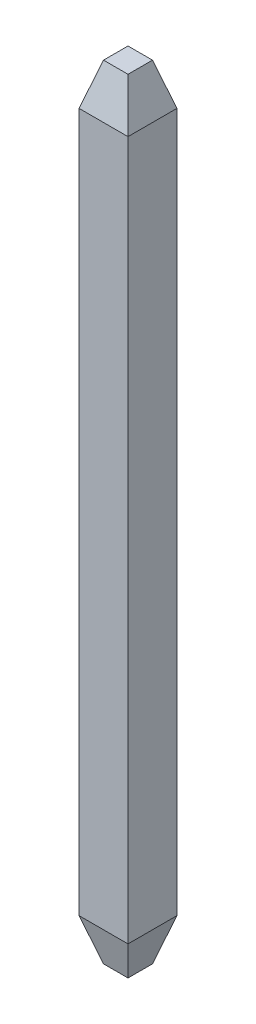
ISO-10303-21;
HEADER;
FILE_DESCRIPTION(('STEP AP214'),'2;1');
FILE_NAME('part.step','',(''),(''),'','','');
FILE_SCHEMA(('AUTOMOTIVE_DESIGN { 1 0 10303 214 1 1 1 1 }'));
ENDSEC;
DATA;
#1=APPLICATION_CONTEXT('core data for automotive mechanical design processes');
#2=APPLICATION_PROTOCOL_DEFINITION('international standard','automotive_design',2000,#1);
#3=PRODUCT_CONTEXT('',#1,'mechanical');
#4=PRODUCT('Part','Part','',(#3));
#5=PRODUCT_RELATED_PRODUCT_CATEGORY('part','',(#4));
#6=PRODUCT_DEFINITION_FORMATION('','',#4);
#7=PRODUCT_DEFINITION_CONTEXT('part definition',#1,'design');
#8=PRODUCT_DEFINITION('design','',#6,#7);
#9=PRODUCT_DEFINITION_SHAPE('','',#8);
#10=(LENGTH_UNIT() NAMED_UNIT(*) SI_UNIT(.MILLI.,.METRE.));
#11=(NAMED_UNIT(*) PLANE_ANGLE_UNIT() SI_UNIT($,.RADIAN.));
#12=(NAMED_UNIT(*) SI_UNIT($,.STERADIAN.) SOLID_ANGLE_UNIT());
#13=UNCERTAINTY_MEASURE_WITH_UNIT(LENGTH_MEASURE(1.E-05),#10,'distance_accuracy_value','');
#14=(GEOMETRIC_REPRESENTATION_CONTEXT(3) GLOBAL_UNCERTAINTY_ASSIGNED_CONTEXT((#13)) GLOBAL_UNIT_ASSIGNED_CONTEXT((#10,
#11,#12)) REPRESENTATION_CONTEXT('',''));
#15=CARTESIAN_POINT('',(0.,0.,0.));
#16=DIRECTION('',(0.,0.,1.));
#17=DIRECTION('',(1.,0.,0.));
#18=AXIS2_PLACEMENT_3D('',#15,#16,#17);
#19=CARTESIAN_POINT('',(6.19000000001294,-5.53543505344786,-19.1989999999763));
#20=DIRECTION('',(-1.,0.,0.));
#21=DIRECTION('',(0.,0.,1.));
#22=AXIS2_PLACEMENT_3D('',#19,#20,#21);
#23=PLANE('',#22);
#24=DIRECTION('',(0.,1.,0.));
#25=VECTOR('',#24,1.);
#26=CARTESIAN_POINT('',(6.19000000001294,-10.1039999999831,-19.8399999999763));
#27=LINE('',#26,#25);
#28=CARTESIAN_POINT('',(6.19000000001294,-10.1039999999831,-19.8399999999763));
#29=VERTEX_POINT('',#28);
#30=CARTESIAN_POINT('',(6.19000000001294,-0.965870106912631,-19.8399999999763));
#31=VERTEX_POINT('',#30);
#32=EDGE_CURVE('E158',#29,#31,#27,.T.);
#33=ORIENTED_EDGE('',*,*,#32,.F.);
#34=DIRECTION('',(0.,0.,-1.));
#35=VECTOR('',#34,1.);
#36=CARTESIAN_POINT('',(6.19000000001294,-10.1039999999831,-19.1999999999763));
#37=LINE('',#36,#35);
#38=CARTESIAN_POINT('',(6.19000000001294,-10.1039999999831,-19.1999999999763));
#39=VERTEX_POINT('',#38);
#40=EDGE_CURVE('E42',#39,#29,#37,.T.);
#41=ORIENTED_EDGE('',*,*,#40,.F.);
#42=DIRECTION('',(0.,1.,0.));
#43=VECTOR('',#42,1.);
#44=CARTESIAN_POINT('',(6.19000000001294,-10.1039999999831,-19.1999999999763));
#45=LINE('',#44,#43);
#46=CARTESIAN_POINT('',(6.19000000001294,-0.965870106912631,-19.1999999999763));
#47=VERTEX_POINT('',#46);
#48=EDGE_CURVE('E11',#39,#47,#45,.T.);
#49=ORIENTED_EDGE('',*,*,#48,.T.);
#50=DIRECTION('',(0.,0.,-1.));
#51=VECTOR('',#50,1.);
#52=CARTESIAN_POINT('',(6.19000000001294,-0.965870106912629,-19.1999999999763));
#53=LINE('',#52,#51);
#54=EDGE_CURVE('E28',#47,#31,#53,.T.);
#55=ORIENTED_EDGE('',*,*,#54,.T.);
#56=EDGE_LOOP('',(#33,#41,#49,#55));
#57=FACE_BOUND('',#56,.T.);
#58=ADVANCED_FACE('F17',(#57),#23,.T.);
#59=CARTESIAN_POINT('',(6.83100000001296,-5.53443505344787,-19.8399999999763));
#60=DIRECTION('',(0.,0.,-1.));
#61=DIRECTION('',(0.,-1.,0.));
#62=AXIS2_PLACEMENT_3D('',#59,#60,#61);
#63=PLANE('',#62);
#64=DIRECTION('',(0.,1.,0.));
#65=VECTOR('',#64,1.);
#66=CARTESIAN_POINT('',(6.83000000001296,-10.1039999999831,-19.8399999999763));
#67=LINE('',#66,#65);
#68=CARTESIAN_POINT('',(6.83000000001293,-10.1039999999831,-19.8399999999763));
#69=VERTEX_POINT('',#68);
#70=CARTESIAN_POINT('',(6.83000000001293,-0.965870106912631,-19.8399999999763));
#71=VERTEX_POINT('',#70);
#72=EDGE_CURVE('E151',#69,#71,#67,.T.);
#73=ORIENTED_EDGE('',*,*,#72,.F.);
#74=DIRECTION('',(1.,0.,0.));
#75=VECTOR('',#74,1.);
#76=CARTESIAN_POINT('',(6.19000000001294,-10.1039999999831,-19.8399999999763));
#77=LINE('',#76,#75);
#78=EDGE_CURVE('E205',#29,#69,#77,.T.);
#79=ORIENTED_EDGE('',*,*,#78,.F.);
#80=ORIENTED_EDGE('',*,*,#32,.T.);
#81=DIRECTION('',(1.,0.,0.));
#82=VECTOR('',#81,1.);
#83=CARTESIAN_POINT('',(6.19000000001294,-0.965870106912629,-19.8399999999763));
#84=LINE('',#83,#82);
#85=EDGE_CURVE('E155',#31,#71,#84,.T.);
#86=ORIENTED_EDGE('',*,*,#85,.T.);
#87=EDGE_LOOP('',(#73,#79,#80,#86));
#88=FACE_BOUND('',#87,.T.);
#89=ADVANCED_FACE('F304',(#88),#63,.T.);
#90=CARTESIAN_POINT('',(6.83000000001296,-11.0738701069126,-19.5199999999763));
#91=DIRECTION('',(1.,0.,0.));
#92=DIRECTION('',(0.,1.,0.));
#93=AXIS2_PLACEMENT_3D('',#90,#91,#92);
#94=PLANE('',#93);
#95=DIRECTION('',(0.,1.,0.));
#96=VECTOR('',#95,1.);
#97=CARTESIAN_POINT('',(6.83000000001296,-10.1039999999831,-19.1999999999763));
#98=LINE('',#97,#96);
#99=CARTESIAN_POINT('',(6.83000000001293,-10.1039999999831,-19.1999999999763));
#100=VERTEX_POINT('',#99);
#101=CARTESIAN_POINT('',(6.83000000001293,-0.965870106912631,-19.1999999999763));
#102=VERTEX_POINT('',#101);
#103=EDGE_CURVE('E160',#100,#102,#98,.T.);
#104=ORIENTED_EDGE('',*,*,#103,.F.);
#105=DIRECTION('',(0.,0.,1.));
#106=VECTOR('',#105,1.);
#107=CARTESIAN_POINT('',(6.83000000001296,-10.1039999999831,-19.8399999999763));
#108=LINE('',#107,#106);
#109=EDGE_CURVE('E266',#69,#100,#108,.T.);
#110=ORIENTED_EDGE('',*,*,#109,.F.);
#111=ORIENTED_EDGE('',*,*,#72,.T.);
#112=DIRECTION('',(0.,0.,1.));
#113=VECTOR('',#112,1.);
#114=CARTESIAN_POINT('',(6.83000000001296,-0.965870106912629,-19.8399999999763));
#115=LINE('',#114,#113);
#116=EDGE_CURVE('E131',#71,#102,#115,.T.);
#117=ORIENTED_EDGE('',*,*,#116,.T.);
#118=EDGE_LOOP('',(#104,#110,#111,#117));
#119=FACE_BOUND('',#118,.T.);
#120=ADVANCED_FACE('F307',(#119),#94,.T.);
#121=CARTESIAN_POINT('',(6.83000000001296,-0.965870106912629,-19.5199999999763));
#122=DIRECTION('',(0.959644900900968,0.281214622974643,0.));
#123=DIRECTION('',(0.,0.,-1.));
#124=AXIS2_PLACEMENT_3D('',#121,#122,#123);
#125=PLANE('',#124);
#126=DIRECTION('',(-0.270714017147727,0.923811583516618,0.270714017147727));
#127=VECTOR('',#126,1.);
#128=CARTESIAN_POINT('',(6.83000000001296,-0.965870106912629,-19.8399999999763));
#129=LINE('',#128,#127);
#130=CARTESIAN_POINT('',(6.67000000001293,-0.419870106912635,-19.6799999999763));
#131=VERTEX_POINT('',#130);
#132=EDGE_CURVE('E137',#71,#131,#129,.T.);
#133=ORIENTED_EDGE('',*,*,#132,.T.);
#134=DIRECTION('',(0.,0.,1.));
#135=VECTOR('',#134,1.);
#136=CARTESIAN_POINT('',(6.67000000001296,-0.419870106912629,-19.6799999999763));
#137=LINE('',#136,#135);
#138=CARTESIAN_POINT('',(6.67000000001293,-0.419870106912635,-19.3599999999763));
#139=VERTEX_POINT('',#138);
#140=EDGE_CURVE('E133',#131,#139,#137,.T.);
#141=ORIENTED_EDGE('',*,*,#140,.T.);
#142=DIRECTION('',(-0.270714017147727,0.923811583516618,-0.270714017147727));
#143=VECTOR('',#142,1.);
#144=CARTESIAN_POINT('',(6.83000000001296,-0.965870106912629,-19.1999999999763));
#145=LINE('',#144,#143);
#146=EDGE_CURVE('E138',#102,#139,#145,.T.);
#147=ORIENTED_EDGE('',*,*,#146,.F.);
#148=ORIENTED_EDGE('',*,*,#116,.F.);
#149=EDGE_LOOP('',(#133,#141,#147,#148));
#150=FACE_BOUND('',#149,.T.);
#151=ADVANCED_FACE('F19',(#150),#125,.T.);
#152=CARTESIAN_POINT('',(6.51000000001295,-0.965870106912629,-19.1999999999763));
#153=DIRECTION('',(0.,0.281214622974643,0.959644900900968));
#154=DIRECTION('',(1.,0.,0.));
#155=AXIS2_PLACEMENT_3D('',#152,#153,#154);
#156=PLANE('',#155);
#157=ORIENTED_EDGE('',*,*,#146,.T.);
#158=DIRECTION('',(-1.,0.,0.));
#159=VECTOR('',#158,1.);
#160=CARTESIAN_POINT('',(6.67000000001296,-0.419870106912629,-19.3599999999763));
#161=LINE('',#160,#159);
#162=CARTESIAN_POINT('',(6.35000000001294,-0.419870106912635,-19.3599999999763));
#163=VERTEX_POINT('',#162);
#164=EDGE_CURVE('E21',#139,#163,#161,.T.);
#165=ORIENTED_EDGE('',*,*,#164,.T.);
#166=DIRECTION('',(0.270714017147727,0.923811583516618,-0.270714017147727));
#167=VECTOR('',#166,1.);
#168=CARTESIAN_POINT('',(6.19000000001294,-0.965870106912629,-19.1999999999763));
#169=LINE('',#168,#167);
#170=EDGE_CURVE('E143',#47,#163,#169,.T.);
#171=ORIENTED_EDGE('',*,*,#170,.F.);
#172=DIRECTION('',(-1.,0.,0.));
#173=VECTOR('',#172,1.);
#174=CARTESIAN_POINT('',(6.83000000001296,-0.965870106912629,-19.1999999999763));
#175=LINE('',#174,#173);
#176=EDGE_CURVE('E127',#102,#47,#175,.T.);
#177=ORIENTED_EDGE('',*,*,#176,.F.);
#178=EDGE_LOOP('',(#157,#165,#171,#177));
#179=FACE_BOUND('',#178,.T.);
#180=ADVANCED_FACE('F351',(#179),#156,.T.);
#181=CARTESIAN_POINT('',(6.51000000001295,-0.419870106912629,-19.6809999999763));
#182=DIRECTION('',(0.,1.,0.));
#183=DIRECTION('',(1.,0.,0.));
#184=AXIS2_PLACEMENT_3D('',#181,#182,#183);
#185=PLANE('',#184);
#186=DIRECTION('',(1.,0.,0.));
#187=VECTOR('',#186,1.);
#188=CARTESIAN_POINT('',(6.35000000001294,-0.419870106912629,-19.6799999999763));
#189=LINE('',#188,#187);
#190=CARTESIAN_POINT('',(6.35000000001294,-0.419870106912635,-19.6799999999763));
#191=VERTEX_POINT('',#190);
#192=EDGE_CURVE('E197',#191,#131,#189,.T.);
#193=ORIENTED_EDGE('',*,*,#192,.F.);
#194=DIRECTION('',(0.,0.,-1.));
#195=VECTOR('',#194,1.);
#196=CARTESIAN_POINT('',(6.35000000001294,-0.419870106912629,-19.3599999999763));
#197=LINE('',#196,#195);
#198=EDGE_CURVE('E146',#163,#191,#197,.T.);
#199=ORIENTED_EDGE('',*,*,#198,.F.);
#200=ORIENTED_EDGE('',*,*,#164,.F.);
#201=ORIENTED_EDGE('',*,*,#140,.F.);
#202=EDGE_LOOP('',(#193,#199,#200,#201));
#203=FACE_BOUND('',#202,.T.);
#204=ADVANCED_FACE('F353',(#203),#185,.T.);
#205=CARTESIAN_POINT('',(6.83000000001296,-10.1039999999831,-19.5199999999763));
#206=DIRECTION('',(0.959644900900968,-0.281214622974644,0.));
#207=DIRECTION('',(0.,0.,-1.));
#208=AXIS2_PLACEMENT_3D('',#205,#206,#207);
#209=PLANE('',#208);
#210=ORIENTED_EDGE('',*,*,#109,.T.);
#211=DIRECTION('',(-0.270714017147728,-0.923811583516617,-0.270714017147728));
#212=VECTOR('',#211,1.);
#213=CARTESIAN_POINT('',(6.83000000001296,-10.1039999999831,-19.1999999999763));
#214=LINE('',#213,#212);
#215=CARTESIAN_POINT('',(6.67000000001293,-10.6499999999831,-19.3599999999763));
#216=VERTEX_POINT('',#215);
#217=EDGE_CURVE('E142',#100,#216,#214,.T.);
#218=ORIENTED_EDGE('',*,*,#217,.T.);
#219=DIRECTION('',(0.,0.,1.));
#220=VECTOR('',#219,1.);
#221=CARTESIAN_POINT('',(6.67000000001296,-10.6499999999831,-19.6799999999763));
#222=LINE('',#221,#220);
#223=CARTESIAN_POINT('',(6.67000000001293,-10.6499999999831,-19.6799999999763));
#224=VERTEX_POINT('',#223);
#225=EDGE_CURVE('E139',#224,#216,#222,.T.);
#226=ORIENTED_EDGE('',*,*,#225,.F.);
#227=DIRECTION('',(-0.270714017147728,-0.923811583516617,0.270714017147728));
#228=VECTOR('',#227,1.);
#229=CARTESIAN_POINT('',(6.83000000001296,-10.1039999999831,-19.8399999999763));
#230=LINE('',#229,#228);
#231=EDGE_CURVE('E106',#69,#224,#230,.T.);
#232=ORIENTED_EDGE('',*,*,#231,.F.);
#233=EDGE_LOOP('',(#210,#218,#226,#232));
#234=FACE_BOUND('',#233,.T.);
#235=ADVANCED_FACE('F311',(#234),#209,.T.);
#236=CARTESIAN_POINT('',(6.34900000001296,-10.6499999999831,-19.5199999999763));
#237=DIRECTION('',(0.,-1.,0.));
#238=DIRECTION('',(0.,0.,-1.));
#239=AXIS2_PLACEMENT_3D('',#236,#237,#238);
#240=PLANE('',#239);
#241=ORIENTED_EDGE('',*,*,#225,.T.);
#242=DIRECTION('',(-1.,0.,0.));
#243=VECTOR('',#242,1.);
#244=CARTESIAN_POINT('',(6.67000000001296,-10.6499999999831,-19.3599999999763));
#245=LINE('',#244,#243);
#246=CARTESIAN_POINT('',(6.35000000001294,-10.6499999999831,-19.3599999999763));
#247=VERTEX_POINT('',#246);
#248=EDGE_CURVE('E116',#216,#247,#245,.T.);
#249=ORIENTED_EDGE('',*,*,#248,.T.);
#250=DIRECTION('',(0.,0.,-1.));
#251=VECTOR('',#250,1.);
#252=CARTESIAN_POINT('',(6.35000000001294,-10.6499999999831,-19.3599999999763));
#253=LINE('',#252,#251);
#254=CARTESIAN_POINT('',(6.35000000001294,-10.6499999999831,-19.6799999999763));
#255=VERTEX_POINT('',#254);
#256=EDGE_CURVE('E110',#247,#255,#253,.T.);
#257=ORIENTED_EDGE('',*,*,#256,.T.);
#258=DIRECTION('',(1.,0.,0.));
#259=VECTOR('',#258,1.);
#260=CARTESIAN_POINT('',(6.35000000001294,-10.6499999999831,-19.6799999999763));
#261=LINE('',#260,#259);
#262=EDGE_CURVE('E101',#255,#224,#261,.T.);
#263=ORIENTED_EDGE('',*,*,#262,.T.);
#264=EDGE_LOOP('',(#241,#249,#257,#263));
#265=FACE_BOUND('',#264,.T.);
#266=ADVANCED_FACE('F114',(#265),#240,.T.);
#267=CARTESIAN_POINT('',(6.51000000001295,-10.1039999999831,-19.1999999999763));
#268=DIRECTION('',(0.,-0.281214622974644,0.959644900900968));
#269=DIRECTION('',(-1.,0.,0.));
#270=AXIS2_PLACEMENT_3D('',#267,#268,#269);
#271=PLANE('',#270);
#272=DIRECTION('',(-1.,0.,0.));
#273=VECTOR('',#272,1.);
#274=CARTESIAN_POINT('',(6.83000000001296,-10.1039999999831,-19.1999999999763));
#275=LINE('',#274,#273);
#276=EDGE_CURVE('E111',#100,#39,#275,.T.);
#277=ORIENTED_EDGE('',*,*,#276,.T.);
#278=DIRECTION('',(0.270714017147728,-0.923811583516617,-0.270714017147728));
#279=VECTOR('',#278,1.);
#280=CARTESIAN_POINT('',(6.19000000001294,-10.1039999999831,-19.1999999999763));
#281=LINE('',#280,#279);
#282=EDGE_CURVE('E150',#39,#247,#281,.T.);
#283=ORIENTED_EDGE('',*,*,#282,.T.);
#284=ORIENTED_EDGE('',*,*,#248,.F.);
#285=ORIENTED_EDGE('',*,*,#217,.F.);
#286=EDGE_LOOP('',(#277,#283,#284,#285));
#287=FACE_BOUND('',#286,.T.);
#288=ADVANCED_FACE('F316',(#287),#271,.T.);
#289=CARTESIAN_POINT('',(6.51000000001295,-0.965870106912629,-19.8399999999763));
#290=DIRECTION('',(0.,0.281214622974643,-0.959644900900968));
#291=DIRECTION('',(-1.,0.,0.));
#292=AXIS2_PLACEMENT_3D('',#289,#290,#291);
#293=PLANE('',#292);
#294=DIRECTION('',(0.270714017147727,0.923811583516618,0.270714017147727));
#295=VECTOR('',#294,1.);
#296=CARTESIAN_POINT('',(6.19000000001294,-0.965870106912629,-19.8399999999763));
#297=LINE('',#296,#295);
#298=EDGE_CURVE('E190',#31,#191,#297,.T.);
#299=ORIENTED_EDGE('',*,*,#298,.T.);
#300=ORIENTED_EDGE('',*,*,#192,.T.);
#301=ORIENTED_EDGE('',*,*,#132,.F.);
#302=ORIENTED_EDGE('',*,*,#85,.F.);
#303=EDGE_LOOP('',(#299,#300,#301,#302));
#304=FACE_BOUND('',#303,.T.);
#305=ADVANCED_FACE('F300',(#304),#293,.T.);
#306=CARTESIAN_POINT('',(6.51000000001295,-10.1039999999831,-19.8399999999763));
#307=DIRECTION('',(0.,-0.281214622974644,-0.959644900900968));
#308=DIRECTION('',(0.,-0.959644900900968,0.281214622974644));
#309=AXIS2_PLACEMENT_3D('',#306,#307,#308);
#310=PLANE('',#309);
#311=ORIENTED_EDGE('',*,*,#78,.T.);
#312=ORIENTED_EDGE('',*,*,#231,.T.);
#313=ORIENTED_EDGE('',*,*,#262,.F.);
#314=DIRECTION('',(0.270714017147728,-0.923811583516617,0.270714017147728));
#315=VECTOR('',#314,1.);
#316=CARTESIAN_POINT('',(6.19000000001294,-10.1039999999831,-19.8399999999763));
#317=LINE('',#316,#315);
#318=EDGE_CURVE('E104',#29,#255,#317,.T.);
#319=ORIENTED_EDGE('',*,*,#318,.F.);
#320=EDGE_LOOP('',(#311,#312,#313,#319));
#321=FACE_BOUND('',#320,.T.);
#322=ADVANCED_FACE('F103',(#321),#310,.T.);
#323=CARTESIAN_POINT('',(6.19000000001294,-0.965870106912629,-19.5199999999763));
#324=DIRECTION('',(-0.959644900900968,0.281214622974643,0.));
#325=DIRECTION('',(0.,0.,1.));
#326=AXIS2_PLACEMENT_3D('',#323,#324,#325);
#327=PLANE('',#326);
#328=ORIENTED_EDGE('',*,*,#170,.T.);
#329=ORIENTED_EDGE('',*,*,#198,.T.);
#330=ORIENTED_EDGE('',*,*,#298,.F.);
#331=ORIENTED_EDGE('',*,*,#54,.F.);
#332=EDGE_LOOP('',(#328,#329,#330,#331));
#333=FACE_BOUND('',#332,.T.);
#334=ADVANCED_FACE('F296',(#333),#327,.T.);
#335=CARTESIAN_POINT('',(6.18900000001297,-5.53543505344787,-19.1999999999763));
#336=DIRECTION('',(0.,0.,1.));
#337=DIRECTION('',(1.,0.,0.));
#338=AXIS2_PLACEMENT_3D('',#335,#336,#337);
#339=PLANE('',#338);
#340=ORIENTED_EDGE('',*,*,#48,.F.);
#341=ORIENTED_EDGE('',*,*,#276,.F.);
#342=ORIENTED_EDGE('',*,*,#103,.T.);
#343=ORIENTED_EDGE('',*,*,#176,.T.);
#344=EDGE_LOOP('',(#340,#341,#342,#343));
#345=FACE_BOUND('',#344,.T.);
#346=ADVANCED_FACE('F313',(#345),#339,.T.);
#347=CARTESIAN_POINT('',(6.19000000001294,-10.1039999999831,-19.5199999999763));
#348=DIRECTION('',(-0.959644900900968,-0.281214622974644,0.));
#349=DIRECTION('',(-0.281214622974644,0.959644900900968,0.));
#350=AXIS2_PLACEMENT_3D('',#347,#348,#349);
#351=PLANE('',#350);
#352=ORIENTED_EDGE('',*,*,#40,.T.);
#353=ORIENTED_EDGE('',*,*,#318,.T.);
#354=ORIENTED_EDGE('',*,*,#256,.F.);
#355=ORIENTED_EDGE('',*,*,#282,.F.);
#356=EDGE_LOOP('',(#352,#353,#354,#355));
#357=FACE_BOUND('',#356,.T.);
#358=ADVANCED_FACE('F120',(#357),#351,.T.);
#359=CLOSED_SHELL('',(#58,#89,#120,#151,#180,#204,#235,#266,#288,#305,#322,#334,#346,#358));
#360=MANIFOLD_SOLID_BREP('B1',#359);
#361=ADVANCED_BREP_SHAPE_REPRESENTATION('',(#18,#360),#14);
#362=SHAPE_DEFINITION_REPRESENTATION(#9,#361);
ENDSEC;
END-ISO-10303-21;
